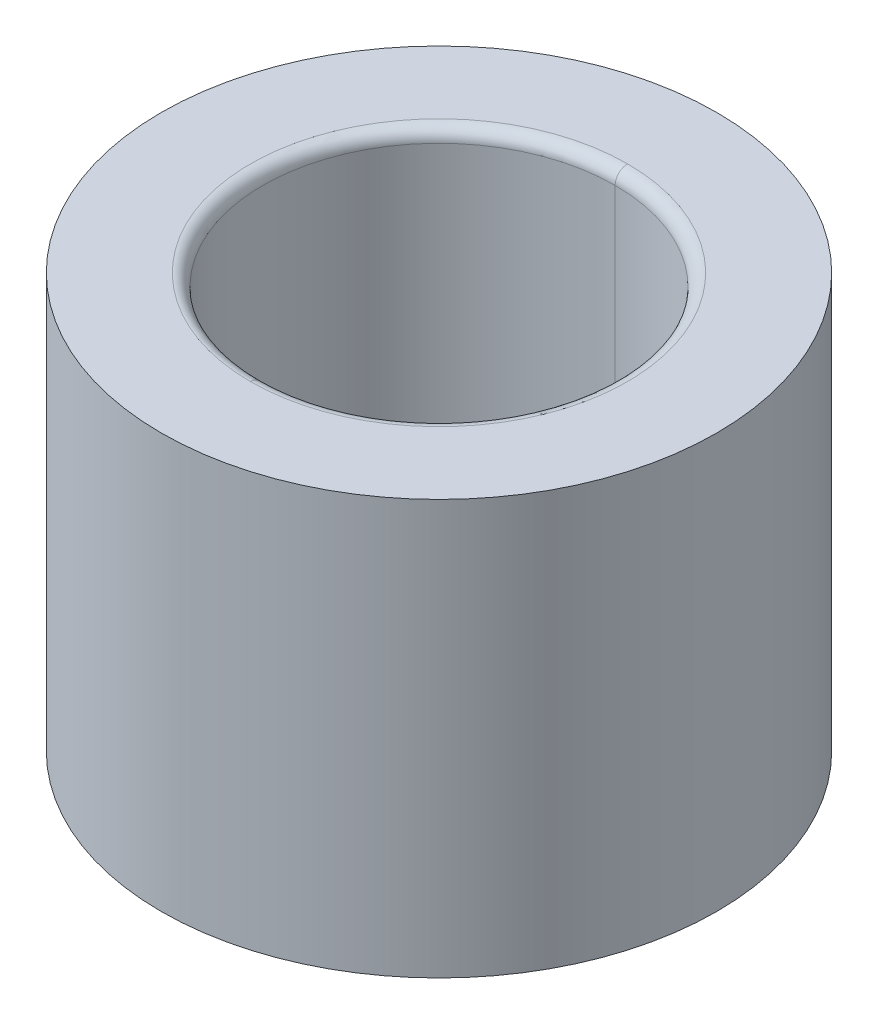
ISO-10303-21;
HEADER;
FILE_DESCRIPTION(('STEP AP214'),'2;1');
FILE_NAME('part.step','',(''),(''),'','','');
FILE_SCHEMA(('AUTOMOTIVE_DESIGN { 1 0 10303 214 1 1 1 1 }'));
ENDSEC;
DATA;
#1=APPLICATION_CONTEXT('core data for automotive mechanical design processes');
#2=APPLICATION_PROTOCOL_DEFINITION('international standard','automotive_design',2000,#1);
#3=PRODUCT_CONTEXT('',#1,'mechanical');
#4=PRODUCT('Part','Part','',(#3));
#5=PRODUCT_RELATED_PRODUCT_CATEGORY('part','',(#4));
#6=PRODUCT_DEFINITION_FORMATION('','',#4);
#7=PRODUCT_DEFINITION_CONTEXT('part definition',#1,'design');
#8=PRODUCT_DEFINITION('design','',#6,#7);
#9=PRODUCT_DEFINITION_SHAPE('','',#8);
#10=(LENGTH_UNIT() NAMED_UNIT(*) SI_UNIT(.MILLI.,.METRE.));
#11=(NAMED_UNIT(*) PLANE_ANGLE_UNIT() SI_UNIT($,.RADIAN.));
#12=(NAMED_UNIT(*) SI_UNIT($,.STERADIAN.) SOLID_ANGLE_UNIT());
#13=UNCERTAINTY_MEASURE_WITH_UNIT(LENGTH_MEASURE(1.E-05),#10,'distance_accuracy_value','');
#14=(GEOMETRIC_REPRESENTATION_CONTEXT(3) GLOBAL_UNCERTAINTY_ASSIGNED_CONTEXT((#13)) GLOBAL_UNIT_ASSIGNED_CONTEXT((#10,
#11,#12)) REPRESENTATION_CONTEXT('',''));
#15=CARTESIAN_POINT('',(0.,0.,0.));
#16=DIRECTION('',(0.,0.,1.));
#17=DIRECTION('',(1.,0.,0.));
#18=AXIS2_PLACEMENT_3D('',#15,#16,#17);
#19=CARTESIAN_POINT('',(0.,4.85,0.));
#20=DIRECTION('',(0.,1.,0.));
#21=DIRECTION('',(0.,0.,1.));
#22=AXIS2_PLACEMENT_3D('',#19,#20,#21);
#23=TOROIDAL_SURFACE('',#22,2.275,0.15);
#24=CARTESIAN_POINT('',(0.,4.85,-2.275));
#25=DIRECTION('',(1.,0.,0.));
#26=DIRECTION('',(0.,0.,-1.));
#27=AXIS2_PLACEMENT_3D('',#24,#25,#26);
#28=CIRCLE('',#27,0.15);
#29=CARTESIAN_POINT('',(0.,5.,-2.275));
#30=VERTEX_POINT('',#29);
#31=CARTESIAN_POINT('',(0.,4.85,-2.125));
#32=VERTEX_POINT('',#31);
#33=EDGE_CURVE('E122',#30,#32,#28,.T.);
#34=ORIENTED_EDGE('',*,*,#33,.F.);
#35=CARTESIAN_POINT('',(0.,5.,0.));
#36=DIRECTION('',(0.,-1.,0.));
#37=DIRECTION('',(0.,0.,1.));
#38=AXIS2_PLACEMENT_3D('',#35,#36,#37);
#39=CIRCLE('',#38,2.275);
#40=CARTESIAN_POINT('',(0.,5.,2.275));
#41=VERTEX_POINT('',#40);
#42=EDGE_CURVE('E63',#41,#30,#39,.T.);
#43=ORIENTED_EDGE('',*,*,#42,.F.);
#44=CARTESIAN_POINT('',(0.,4.85,2.275));
#45=DIRECTION('',(-1.,0.,0.));
#46=DIRECTION('',(0.,0.,1.));
#47=AXIS2_PLACEMENT_3D('',#44,#45,#46);
#48=CIRCLE('',#47,0.15);
#49=CARTESIAN_POINT('',(0.,4.85,2.125));
#50=VERTEX_POINT('',#49);
#51=EDGE_CURVE('E57',#41,#50,#48,.T.);
#52=ORIENTED_EDGE('',*,*,#51,.T.);
#53=CARTESIAN_POINT('',(0.,4.85,0.));
#54=DIRECTION('',(0.,1.,0.));
#55=DIRECTION('',(0.,0.,1.));
#56=AXIS2_PLACEMENT_3D('',#53,#54,#55);
#57=CIRCLE('',#56,2.125);
#58=EDGE_CURVE('E112',#32,#50,#57,.T.);
#59=ORIENTED_EDGE('',*,*,#58,.F.);
#60=EDGE_LOOP('',(#34,#43,#52,#59));
#61=FACE_BOUND('',#60,.T.);
#62=ADVANCED_FACE('F53',(#61),#23,.T.);
#63=CARTESIAN_POINT('',(0.,0.15,0.));
#64=DIRECTION('',(0.,1.,0.));
#65=DIRECTION('',(0.,0.,1.));
#66=AXIS2_PLACEMENT_3D('',#63,#64,#65);
#67=TOROIDAL_SURFACE('',#66,2.275,0.15);
#68=CARTESIAN_POINT('',(0.,0.15,-2.275));
#69=DIRECTION('',(1.,0.,0.));
#70=DIRECTION('',(0.,0.,-1.));
#71=AXIS2_PLACEMENT_3D('',#68,#69,#70);
#72=CIRCLE('',#71,0.15);
#73=CARTESIAN_POINT('',(0.,0.15,-2.125));
#74=VERTEX_POINT('',#73);
#75=CARTESIAN_POINT('',(0.,0.,-2.275));
#76=VERTEX_POINT('',#75);
#77=EDGE_CURVE('E150',#74,#76,#72,.T.);
#78=ORIENTED_EDGE('',*,*,#77,.F.);
#79=CARTESIAN_POINT('',(0.,0.15,0.));
#80=DIRECTION('',(0.,-1.,0.));
#81=DIRECTION('',(0.,0.,1.));
#82=AXIS2_PLACEMENT_3D('',#79,#80,#81);
#83=CIRCLE('',#82,2.125);
#84=CARTESIAN_POINT('',(0.,0.15,2.125));
#85=VERTEX_POINT('',#84);
#86=EDGE_CURVE('E114',#85,#74,#83,.T.);
#87=ORIENTED_EDGE('',*,*,#86,.F.);
#88=CARTESIAN_POINT('',(0.,0.15,2.275));
#89=DIRECTION('',(-1.,0.,0.));
#90=DIRECTION('',(0.,0.,1.));
#91=AXIS2_PLACEMENT_3D('',#88,#89,#90);
#92=CIRCLE('',#91,0.15);
#93=CARTESIAN_POINT('',(0.,0.,2.275));
#94=VERTEX_POINT('',#93);
#95=EDGE_CURVE('E128',#85,#94,#92,.T.);
#96=ORIENTED_EDGE('',*,*,#95,.T.);
#97=CARTESIAN_POINT('',(0.,0.,0.));
#98=DIRECTION('',(0.,1.,0.));
#99=DIRECTION('',(0.,0.,1.));
#100=AXIS2_PLACEMENT_3D('',#97,#98,#99);
#101=CIRCLE('',#100,2.275);
#102=EDGE_CURVE('E11',#76,#94,#101,.T.);
#103=ORIENTED_EDGE('',*,*,#102,.F.);
#104=EDGE_LOOP('',(#78,#87,#96,#103));
#105=FACE_BOUND('',#104,.T.);
#106=ADVANCED_FACE('F169',(#105),#67,.T.);
#107=CARTESIAN_POINT('',(0.,5.,0.));
#108=DIRECTION('',(0.,-1.,0.));
#109=DIRECTION('',(0.,0.,-1.));
#110=AXIS2_PLACEMENT_3D('',#107,#108,#109);
#111=CYLINDRICAL_SURFACE('',#110,2.125);
#112=DIRECTION('',(0.,-1.,0.));
#113=VECTOR('',#112,1.);
#114=CARTESIAN_POINT('',(0.,5.,2.125));
#115=LINE('',#114,#113);
#116=EDGE_CURVE('E127',#50,#85,#115,.T.);
#117=ORIENTED_EDGE('',*,*,#116,.F.);
#118=CARTESIAN_POINT('',(0.,4.85,0.));
#119=DIRECTION('',(0.,1.,0.));
#120=DIRECTION('',(0.,0.,1.));
#121=AXIS2_PLACEMENT_3D('',#118,#119,#120);
#122=CIRCLE('',#121,2.125);
#123=EDGE_CURVE('E130',#50,#32,#122,.T.);
#124=ORIENTED_EDGE('',*,*,#123,.T.);
#125=DIRECTION('',(0.,-1.,0.));
#126=VECTOR('',#125,1.);
#127=CARTESIAN_POINT('',(0.,5.,-2.125));
#128=LINE('',#127,#126);
#129=EDGE_CURVE('E108',#32,#74,#128,.T.);
#130=ORIENTED_EDGE('',*,*,#129,.T.);
#131=CARTESIAN_POINT('',(0.,0.15,0.));
#132=DIRECTION('',(0.,-1.,0.));
#133=DIRECTION('',(0.,0.,1.));
#134=AXIS2_PLACEMENT_3D('',#131,#132,#133);
#135=CIRCLE('',#134,2.125);
#136=EDGE_CURVE('E155',#74,#85,#135,.T.);
#137=ORIENTED_EDGE('',*,*,#136,.T.);
#138=EDGE_LOOP('',(#117,#124,#130,#137));
#139=FACE_BOUND('',#138,.T.);
#140=ADVANCED_FACE('F131',(#139),#111,.F.);
#141=CARTESIAN_POINT('',(0.,0.,0.));
#142=DIRECTION('',(0.,1.,0.));
#143=DIRECTION('',(1.,0.,0.));
#144=AXIS2_PLACEMENT_3D('',#141,#142,#143);
#145=PLANE('',#144);
#146=CARTESIAN_POINT('',(0.,0.,0.));
#147=DIRECTION('',(0.,1.,0.));
#148=DIRECTION('',(0.,0.,1.));
#149=AXIS2_PLACEMENT_3D('',#146,#147,#148);
#150=CIRCLE('',#149,2.275);
#151=EDGE_CURVE('E148',#94,#76,#150,.T.);
#152=ORIENTED_EDGE('',*,*,#151,.T.);
#153=ORIENTED_EDGE('',*,*,#102,.T.);
#154=EDGE_LOOP('',(#152,#153));
#155=FACE_BOUND('',#154,.T.);
#156=CARTESIAN_POINT('',(0.,0.,0.));
#157=DIRECTION('',(0.,-1.,0.));
#158=DIRECTION('',(0.,0.,1.));
#159=AXIS2_PLACEMENT_3D('',#156,#157,#158);
#160=CIRCLE('',#159,3.35);
#161=CARTESIAN_POINT('',(0.,0.,3.35));
#162=VERTEX_POINT('',#161);
#163=EDGE_CURVE('E145',#162,#162,#160,.T.);
#164=ORIENTED_EDGE('',*,*,#163,.T.);
#165=EDGE_LOOP('',(#164));
#166=FACE_BOUND('',#165,.T.);
#167=ADVANCED_FACE('F173',(#155,#166),#145,.F.);
#168=CARTESIAN_POINT('',(0.,5.,0.));
#169=DIRECTION('',(0.,1.,0.));
#170=DIRECTION('',(1.,0.,0.));
#171=AXIS2_PLACEMENT_3D('',#168,#169,#170);
#172=PLANE('',#171);
#173=ORIENTED_EDGE('',*,*,#42,.T.);
#174=CARTESIAN_POINT('',(0.,5.,0.));
#175=DIRECTION('',(0.,-1.,0.));
#176=DIRECTION('',(0.,0.,1.));
#177=AXIS2_PLACEMENT_3D('',#174,#175,#176);
#178=CIRCLE('',#177,2.275);
#179=EDGE_CURVE('E136',#30,#41,#178,.T.);
#180=ORIENTED_EDGE('',*,*,#179,.T.);
#181=EDGE_LOOP('',(#173,#180));
#182=FACE_BOUND('',#181,.T.);
#183=CARTESIAN_POINT('',(0.,5.,0.));
#184=DIRECTION('',(0.,1.,0.));
#185=DIRECTION('',(0.,0.,1.));
#186=AXIS2_PLACEMENT_3D('',#183,#184,#185);
#187=CIRCLE('',#186,3.35);
#188=CARTESIAN_POINT('',(0.,5.,3.35));
#189=VERTEX_POINT('',#188);
#190=EDGE_CURVE('E141',#189,#189,#187,.T.);
#191=ORIENTED_EDGE('',*,*,#190,.T.);
#192=EDGE_LOOP('',(#191));
#193=FACE_BOUND('',#192,.T.);
#194=ADVANCED_FACE('F176',(#182,#193),#172,.T.);
#195=CARTESIAN_POINT('',(0.,5.,0.));
#196=DIRECTION('',(0.,-1.,0.));
#197=DIRECTION('',(0.,0.,-1.));
#198=AXIS2_PLACEMENT_3D('',#195,#196,#197);
#199=CYLINDRICAL_SURFACE('',#198,2.125);
#200=ORIENTED_EDGE('',*,*,#58,.T.);
#201=ORIENTED_EDGE('',*,*,#116,.T.);
#202=ORIENTED_EDGE('',*,*,#86,.T.);
#203=ORIENTED_EDGE('',*,*,#129,.F.);
#204=EDGE_LOOP('',(#200,#201,#202,#203));
#205=FACE_BOUND('',#204,.T.);
#206=ADVANCED_FACE('F110',(#205),#199,.F.);
#207=CARTESIAN_POINT('',(0.,0.15,0.));
#208=DIRECTION('',(0.,1.,0.));
#209=DIRECTION('',(0.,0.,1.));
#210=AXIS2_PLACEMENT_3D('',#207,#208,#209);
#211=TOROIDAL_SURFACE('',#210,2.275,0.15);
#212=ORIENTED_EDGE('',*,*,#136,.F.);
#213=ORIENTED_EDGE('',*,*,#77,.T.);
#214=ORIENTED_EDGE('',*,*,#151,.F.);
#215=ORIENTED_EDGE('',*,*,#95,.F.);
#216=EDGE_LOOP('',(#212,#213,#214,#215));
#217=FACE_BOUND('',#216,.T.);
#218=ADVANCED_FACE('F172',(#217),#211,.T.);
#219=CARTESIAN_POINT('',(0.,4.85,0.));
#220=DIRECTION('',(0.,1.,0.));
#221=DIRECTION('',(0.,0.,1.));
#222=AXIS2_PLACEMENT_3D('',#219,#220,#221);
#223=TOROIDAL_SURFACE('',#222,2.275,0.15);
#224=ORIENTED_EDGE('',*,*,#179,.F.);
#225=ORIENTED_EDGE('',*,*,#33,.T.);
#226=ORIENTED_EDGE('',*,*,#123,.F.);
#227=ORIENTED_EDGE('',*,*,#51,.F.);
#228=EDGE_LOOP('',(#224,#225,#226,#227));
#229=FACE_BOUND('',#228,.T.);
#230=ADVANCED_FACE('F55',(#229),#223,.T.);
#231=CARTESIAN_POINT('',(0.,0.,0.));
#232=DIRECTION('',(0.,1.,0.));
#233=DIRECTION('',(0.,0.,1.));
#234=AXIS2_PLACEMENT_3D('',#231,#232,#233);
#235=CYLINDRICAL_SURFACE('',#234,3.35);
#236=ORIENTED_EDGE('',*,*,#163,.F.);
#237=EDGE_LOOP('',(#236));
#238=FACE_BOUND('',#237,.T.);
#239=ORIENTED_EDGE('',*,*,#190,.F.);
#240=EDGE_LOOP('',(#239));
#241=FACE_BOUND('',#240,.T.);
#242=ADVANCED_FACE('F209',(#238,#241),#235,.T.);
#243=CLOSED_SHELL('',(#62,#106,#140,#167,#194,#206,#218,#230,#242));
#244=MANIFOLD_SOLID_BREP('B2',#243);
#245=ADVANCED_BREP_SHAPE_REPRESENTATION('',(#18,#244),#14);
#246=SHAPE_DEFINITION_REPRESENTATION(#9,#245);
ENDSEC;
END-ISO-10303-21;
